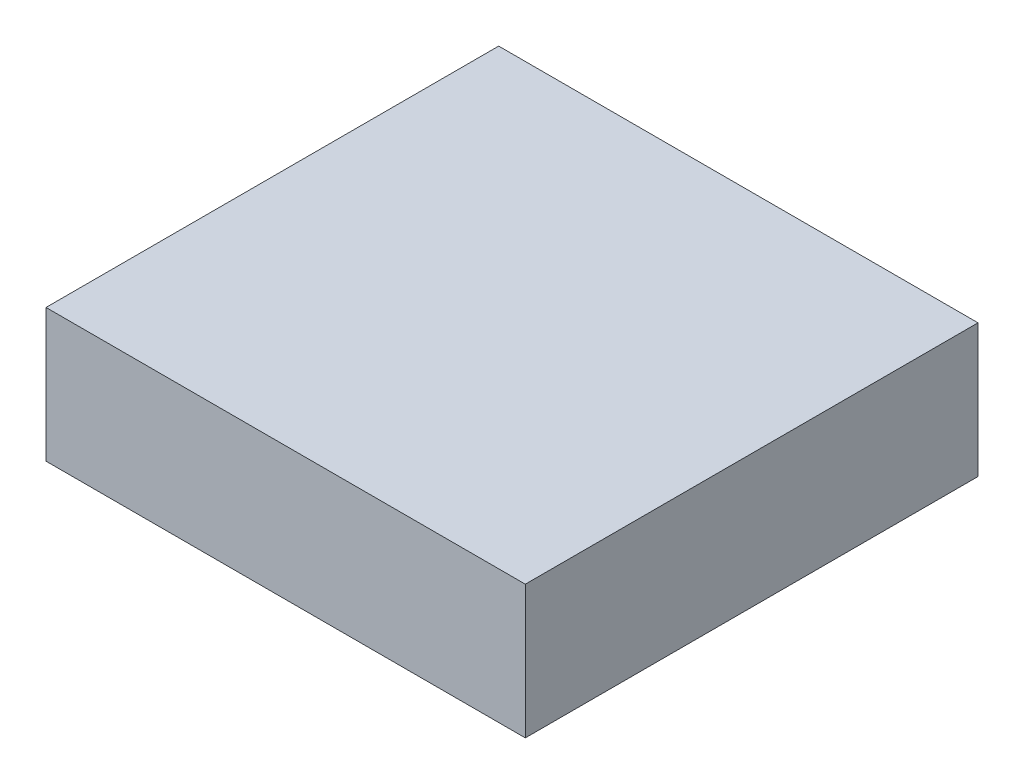
ISO-10303-21;
HEADER;
FILE_DESCRIPTION(('STEP AP214'),'2;1');
FILE_NAME('part.step','',(''),(''),'','','');
FILE_SCHEMA(('AUTOMOTIVE_DESIGN { 1 0 10303 214 1 1 1 1 }'));
ENDSEC;
DATA;
#1=APPLICATION_CONTEXT('core data for automotive mechanical design processes');
#2=APPLICATION_PROTOCOL_DEFINITION('international standard','automotive_design',2000,#1);
#3=PRODUCT_CONTEXT('',#1,'mechanical');
#4=PRODUCT('Part','Part','',(#3));
#5=PRODUCT_RELATED_PRODUCT_CATEGORY('part','',(#4));
#6=PRODUCT_DEFINITION_FORMATION('','',#4);
#7=PRODUCT_DEFINITION_CONTEXT('part definition',#1,'design');
#8=PRODUCT_DEFINITION('design','',#6,#7);
#9=PRODUCT_DEFINITION_SHAPE('','',#8);
#10=(LENGTH_UNIT() NAMED_UNIT(*) SI_UNIT(.MILLI.,.METRE.));
#11=(NAMED_UNIT(*) PLANE_ANGLE_UNIT() SI_UNIT($,.RADIAN.));
#12=(NAMED_UNIT(*) SI_UNIT($,.STERADIAN.) SOLID_ANGLE_UNIT());
#13=UNCERTAINTY_MEASURE_WITH_UNIT(LENGTH_MEASURE(1.E-05),#10,'distance_accuracy_value','');
#14=(GEOMETRIC_REPRESENTATION_CONTEXT(3) GLOBAL_UNCERTAINTY_ASSIGNED_CONTEXT((#13)) GLOBAL_UNIT_ASSIGNED_CONTEXT((#10,
#11,#12)) REPRESENTATION_CONTEXT('',''));
#15=CARTESIAN_POINT('',(0.,0.,0.));
#16=DIRECTION('',(0.,0.,1.));
#17=DIRECTION('',(1.,0.,0.));
#18=AXIS2_PLACEMENT_3D('',#15,#16,#17);
#19=CARTESIAN_POINT('',(90.,-12.5,-42.5));
#20=DIRECTION('',(0.,0.,1.));
#21=DIRECTION('',(1.,0.,0.));
#22=AXIS2_PLACEMENT_3D('',#19,#20,#21);
#23=PLANE('',#22);
#24=DIRECTION('',(0.,1.,0.));
#25=VECTOR('',#24,1.);
#26=CARTESIAN_POINT('',(0.,-12.5,-42.5));
#27=LINE('',#26,#25);
#28=CARTESIAN_POINT('',(0.,-12.5,-42.5));
#29=VERTEX_POINT('',#28);
#30=CARTESIAN_POINT('',(0.,12.5,-42.5));
#31=VERTEX_POINT('',#30);
#32=EDGE_CURVE('E99',#29,#31,#27,.T.);
#33=ORIENTED_EDGE('',*,*,#32,.T.);
#34=DIRECTION('',(-1.,0.,0.));
#35=VECTOR('',#34,1.);
#36=CARTESIAN_POINT('',(90.,12.5,-42.5));
#37=LINE('',#36,#35);
#38=CARTESIAN_POINT('',(90.,12.5,-42.5));
#39=VERTEX_POINT('',#38);
#40=EDGE_CURVE('E11',#39,#31,#37,.T.);
#41=ORIENTED_EDGE('',*,*,#40,.F.);
#42=DIRECTION('',(0.,1.,0.));
#43=VECTOR('',#42,1.);
#44=CARTESIAN_POINT('',(90.,-12.5,-42.5));
#45=LINE('',#44,#43);
#46=CARTESIAN_POINT('',(90.,-12.5,-42.5));
#47=VERTEX_POINT('',#46);
#48=EDGE_CURVE('E87',#47,#39,#45,.T.);
#49=ORIENTED_EDGE('',*,*,#48,.F.);
#50=DIRECTION('',(-1.,0.,0.));
#51=VECTOR('',#50,1.);
#52=CARTESIAN_POINT('',(90.,-12.5,-42.5));
#53=LINE('',#52,#51);
#54=EDGE_CURVE('E95',#47,#29,#53,.T.);
#55=ORIENTED_EDGE('',*,*,#54,.T.);
#56=EDGE_LOOP('',(#33,#41,#49,#55));
#57=FACE_BOUND('',#56,.T.);
#58=ADVANCED_FACE('F36',(#57),#23,.F.);
#59=CARTESIAN_POINT('',(90.,12.5,42.5));
#60=DIRECTION('',(0.,-1.,0.));
#61=DIRECTION('',(0.,0.,-1.));
#62=AXIS2_PLACEMENT_3D('',#59,#60,#61);
#63=PLANE('',#62);
#64=DIRECTION('',(0.,0.,1.));
#65=VECTOR('',#64,1.);
#66=CARTESIAN_POINT('',(0.,12.5,42.5));
#67=LINE('',#66,#65);
#68=CARTESIAN_POINT('',(0.,12.5,42.5));
#69=VERTEX_POINT('',#68);
#70=EDGE_CURVE('E91',#31,#69,#67,.T.);
#71=ORIENTED_EDGE('',*,*,#70,.T.);
#72=DIRECTION('',(-1.,0.,0.));
#73=VECTOR('',#72,1.);
#74=CARTESIAN_POINT('',(90.,12.5,42.5));
#75=LINE('',#74,#73);
#76=CARTESIAN_POINT('',(90.,12.5,42.5));
#77=VERTEX_POINT('',#76);
#78=EDGE_CURVE('E44',#77,#69,#75,.T.);
#79=ORIENTED_EDGE('',*,*,#78,.F.);
#80=DIRECTION('',(0.,0.,1.));
#81=VECTOR('',#80,1.);
#82=CARTESIAN_POINT('',(90.,12.5,42.5));
#83=LINE('',#82,#81);
#84=EDGE_CURVE('E82',#39,#77,#83,.T.);
#85=ORIENTED_EDGE('',*,*,#84,.F.);
#86=ORIENTED_EDGE('',*,*,#40,.T.);
#87=EDGE_LOOP('',(#71,#79,#85,#86));
#88=FACE_BOUND('',#87,.T.);
#89=ADVANCED_FACE('F90',(#88),#63,.F.);
#90=CARTESIAN_POINT('',(90.,-12.5,42.5));
#91=DIRECTION('',(0.,0.,-1.));
#92=DIRECTION('',(-1.,0.,0.));
#93=AXIS2_PLACEMENT_3D('',#90,#91,#92);
#94=PLANE('',#93);
#95=DIRECTION('',(0.,-1.,0.));
#96=VECTOR('',#95,1.);
#97=CARTESIAN_POINT('',(0.,-12.5,42.5));
#98=LINE('',#97,#96);
#99=CARTESIAN_POINT('',(0.,-12.5,42.5));
#100=VERTEX_POINT('',#99);
#101=EDGE_CURVE('E69',#69,#100,#98,.T.);
#102=ORIENTED_EDGE('',*,*,#101,.T.);
#103=DIRECTION('',(-1.,0.,0.));
#104=VECTOR('',#103,1.);
#105=CARTESIAN_POINT('',(90.,-12.5,42.5));
#106=LINE('',#105,#104);
#107=CARTESIAN_POINT('',(90.,-12.5,42.5));
#108=VERTEX_POINT('',#107);
#109=EDGE_CURVE('E92',#108,#100,#106,.T.);
#110=ORIENTED_EDGE('',*,*,#109,.F.);
#111=DIRECTION('',(0.,-1.,0.));
#112=VECTOR('',#111,1.);
#113=CARTESIAN_POINT('',(90.,-12.5,42.5));
#114=LINE('',#113,#112);
#115=EDGE_CURVE('E85',#77,#108,#114,.T.);
#116=ORIENTED_EDGE('',*,*,#115,.F.);
#117=ORIENTED_EDGE('',*,*,#78,.T.);
#118=EDGE_LOOP('',(#102,#110,#116,#117));
#119=FACE_BOUND('',#118,.T.);
#120=ADVANCED_FACE('F93',(#119),#94,.F.);
#121=CARTESIAN_POINT('',(90.,-12.5,42.5));
#122=DIRECTION('',(0.,1.,0.));
#123=DIRECTION('',(0.,0.,1.));
#124=AXIS2_PLACEMENT_3D('',#121,#122,#123);
#125=PLANE('',#124);
#126=DIRECTION('',(0.,0.,-1.));
#127=VECTOR('',#126,1.);
#128=CARTESIAN_POINT('',(0.,-12.5,42.5));
#129=LINE('',#128,#127);
#130=EDGE_CURVE('E75',#100,#29,#129,.T.);
#131=ORIENTED_EDGE('',*,*,#130,.T.);
#132=ORIENTED_EDGE('',*,*,#54,.F.);
#133=DIRECTION('',(0.,0.,-1.));
#134=VECTOR('',#133,1.);
#135=CARTESIAN_POINT('',(90.,-12.5,42.5));
#136=LINE('',#135,#134);
#137=EDGE_CURVE('E52',#108,#47,#136,.T.);
#138=ORIENTED_EDGE('',*,*,#137,.F.);
#139=ORIENTED_EDGE('',*,*,#109,.T.);
#140=EDGE_LOOP('',(#131,#132,#138,#139));
#141=FACE_BOUND('',#140,.T.);
#142=ADVANCED_FACE('F106',(#141),#125,.F.);
#143=CARTESIAN_POINT('',(90.,0.,0.));
#144=DIRECTION('',(-1.,0.,0.));
#145=DIRECTION('',(0.,0.,1.));
#146=AXIS2_PLACEMENT_3D('',#143,#144,#145);
#147=PLANE('',#146);
#148=ORIENTED_EDGE('',*,*,#48,.T.);
#149=ORIENTED_EDGE('',*,*,#84,.T.);
#150=ORIENTED_EDGE('',*,*,#115,.T.);
#151=ORIENTED_EDGE('',*,*,#137,.T.);
#152=EDGE_LOOP('',(#148,#149,#150,#151));
#153=FACE_BOUND('',#152,.T.);
#154=ADVANCED_FACE('F83',(#153),#147,.F.);
#155=CARTESIAN_POINT('',(0.,0.,0.));
#156=DIRECTION('',(-1.,0.,0.));
#157=DIRECTION('',(0.,0.,1.));
#158=AXIS2_PLACEMENT_3D('',#155,#156,#157);
#159=PLANE('',#158);
#160=ORIENTED_EDGE('',*,*,#32,.F.);
#161=ORIENTED_EDGE('',*,*,#130,.F.);
#162=ORIENTED_EDGE('',*,*,#101,.F.);
#163=ORIENTED_EDGE('',*,*,#70,.F.);
#164=EDGE_LOOP('',(#160,#161,#162,#163));
#165=FACE_BOUND('',#164,.T.);
#166=ADVANCED_FACE('F109',(#165),#159,.T.);
#167=CLOSED_SHELL('',(#58,#89,#120,#142,#154,#166));
#168=MANIFOLD_SOLID_BREP('B2',#167);
#169=ADVANCED_BREP_SHAPE_REPRESENTATION('',(#18,#168),#14);
#170=SHAPE_DEFINITION_REPRESENTATION(#9,#169);
ENDSEC;
END-ISO-10303-21;
